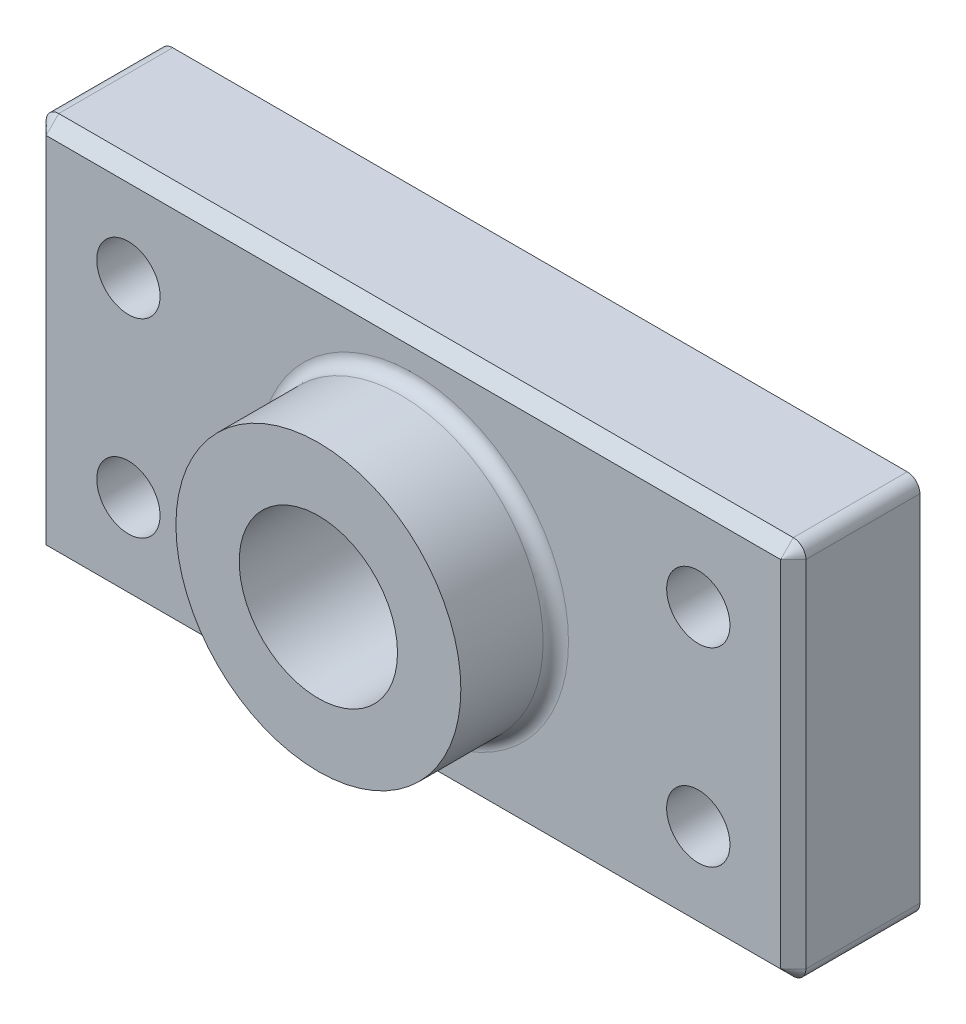
ISO-10303-21;
HEADER;
FILE_DESCRIPTION(('STEP AP214'),'2;1');
FILE_NAME('part.step','',(''),(''),'','','');
FILE_SCHEMA(('AUTOMOTIVE_DESIGN { 1 0 10303 214 1 1 1 1 }'));
ENDSEC;
DATA;
#1=APPLICATION_CONTEXT('core data for automotive mechanical design processes');
#2=APPLICATION_PROTOCOL_DEFINITION('international standard','automotive_design',2000,#1);
#3=PRODUCT_CONTEXT('',#1,'mechanical');
#4=PRODUCT('Part','Part','',(#3));
#5=PRODUCT_RELATED_PRODUCT_CATEGORY('part','',(#4));
#6=PRODUCT_DEFINITION_FORMATION('','',#4);
#7=PRODUCT_DEFINITION_CONTEXT('part definition',#1,'design');
#8=PRODUCT_DEFINITION('design','',#6,#7);
#9=PRODUCT_DEFINITION_SHAPE('','',#8);
#10=(LENGTH_UNIT() NAMED_UNIT(*) SI_UNIT(.MILLI.,.METRE.));
#11=(NAMED_UNIT(*) PLANE_ANGLE_UNIT() SI_UNIT($,.RADIAN.));
#12=(NAMED_UNIT(*) SI_UNIT($,.STERADIAN.) SOLID_ANGLE_UNIT());
#13=UNCERTAINTY_MEASURE_WITH_UNIT(LENGTH_MEASURE(1.E-05),#10,'distance_accuracy_value','');
#14=(GEOMETRIC_REPRESENTATION_CONTEXT(3) GLOBAL_UNCERTAINTY_ASSIGNED_CONTEXT((#13)) GLOBAL_UNIT_ASSIGNED_CONTEXT((#10,
#11,#12)) REPRESENTATION_CONTEXT('',''));
#15=CARTESIAN_POINT('',(0.,0.,0.));
#16=DIRECTION('',(0.,0.,1.));
#17=DIRECTION('',(1.,0.,0.));
#18=AXIS2_PLACEMENT_3D('',#15,#16,#17);
#19=CARTESIAN_POINT('',(0.,0.,25.4));
#20=DIRECTION('',(0.,0.,1.));
#21=DIRECTION('',(1.,0.,0.));
#22=AXIS2_PLACEMENT_3D('',#19,#20,#21);
#23=PLANE('',#22);
#24=DIRECTION('',(0.,-1.,0.));
#25=VECTOR('',#24,1.);
#26=CARTESIAN_POINT('',(-73.66,-35.56,25.4));
#27=LINE('',#26,#25);
#28=CARTESIAN_POINT('',(-73.66,35.56,25.4));
#29=VERTEX_POINT('',#28);
#30=CARTESIAN_POINT('',(-73.66,-35.56,25.4));
#31=VERTEX_POINT('',#30);
#32=EDGE_CURVE('E213',#29,#31,#27,.T.);
#33=ORIENTED_EDGE('',*,*,#32,.T.);
#34=DIRECTION('',(1.,0.,0.));
#35=VECTOR('',#34,1.);
#36=CARTESIAN_POINT('',(73.66,-35.56,25.4));
#37=LINE('',#36,#35);
#38=CARTESIAN_POINT('',(73.66,-35.56,25.4));
#39=VERTEX_POINT('',#38);
#40=EDGE_CURVE('E219',#31,#39,#37,.T.);
#41=ORIENTED_EDGE('',*,*,#40,.T.);
#42=DIRECTION('',(0.,1.,0.));
#43=VECTOR('',#42,1.);
#44=CARTESIAN_POINT('',(73.66,35.56,25.4));
#45=LINE('',#44,#43);
#46=CARTESIAN_POINT('',(73.66,35.56,25.4));
#47=VERTEX_POINT('',#46);
#48=EDGE_CURVE('E216',#39,#47,#45,.T.);
#49=ORIENTED_EDGE('',*,*,#48,.T.);
#50=DIRECTION('',(-1.,0.,0.));
#51=VECTOR('',#50,1.);
#52=CARTESIAN_POINT('',(-73.6599999999999,35.56,25.4));
#53=LINE('',#52,#51);
#54=EDGE_CURVE('E210',#47,#29,#53,.T.);
#55=ORIENTED_EDGE('',*,*,#54,.T.);
#56=EDGE_LOOP('',(#33,#41,#49,#55));
#57=FACE_BOUND('',#56,.T.);
#58=CARTESIAN_POINT('',(0.,0.,25.4));
#59=DIRECTION('',(0.,0.,1.));
#60=DIRECTION('',(1.,0.,0.));
#61=AXIS2_PLACEMENT_3D('',#58,#59,#60);
#62=CIRCLE('',#61,31.115);
#63=CARTESIAN_POINT('',(31.115,0.,25.4));
#64=VERTEX_POINT('',#63);
#65=EDGE_CURVE('E180',#64,#64,#62,.F.);
#66=ORIENTED_EDGE('',*,*,#65,.T.);
#67=EDGE_LOOP('',(#66));
#68=FACE_BOUND('',#67,.T.);
#69=CARTESIAN_POINT('',(57.1500000000001,19.0499999999999,25.4));
#70=DIRECTION('',(0.,0.,1.));
#71=DIRECTION('',(-1.,0.,0.));
#72=AXIS2_PLACEMENT_3D('',#69,#70,#71);
#73=CIRCLE('',#72,6.35000000000001);
#74=CARTESIAN_POINT('',(50.8000000000001,19.0499999999999,25.4));
#75=VERTEX_POINT('',#74);
#76=EDGE_CURVE('E294',#75,#75,#73,.T.);
#77=ORIENTED_EDGE('',*,*,#76,.F.);
#78=EDGE_LOOP('',(#77));
#79=FACE_BOUND('',#78,.T.);
#80=CARTESIAN_POINT('',(-57.15,19.05,25.4));
#81=DIRECTION('',(0.,0.,1.));
#82=DIRECTION('',(1.,0.,0.));
#83=AXIS2_PLACEMENT_3D('',#80,#81,#82);
#84=CIRCLE('',#83,6.35);
#85=CARTESIAN_POINT('',(-50.8,19.05,25.4));
#86=VERTEX_POINT('',#85);
#87=EDGE_CURVE('E310',#86,#86,#84,.T.);
#88=ORIENTED_EDGE('',*,*,#87,.F.);
#89=EDGE_LOOP('',(#88));
#90=FACE_BOUND('',#89,.T.);
#91=CARTESIAN_POINT('',(-57.15,-19.0500000000001,25.4));
#92=DIRECTION('',(0.,0.,1.));
#93=DIRECTION('',(-1.,0.,0.));
#94=AXIS2_PLACEMENT_3D('',#91,#92,#93);
#95=CIRCLE('',#94,6.35);
#96=CARTESIAN_POINT('',(-63.5,-19.0500000000001,25.4));
#97=VERTEX_POINT('',#96);
#98=EDGE_CURVE('E302',#97,#97,#95,.T.);
#99=ORIENTED_EDGE('',*,*,#98,.F.);
#100=EDGE_LOOP('',(#99));
#101=FACE_BOUND('',#100,.T.);
#102=CARTESIAN_POINT('',(57.15,-19.0500000000002,25.4));
#103=DIRECTION('',(0.,0.,1.));
#104=DIRECTION('',(1.,0.,0.));
#105=AXIS2_PLACEMENT_3D('',#102,#103,#104);
#106=CIRCLE('',#105,6.35);
#107=CARTESIAN_POINT('',(63.5,-19.0500000000002,25.4));
#108=VERTEX_POINT('',#107);
#109=EDGE_CURVE('E286',#108,#108,#106,.T.);
#110=ORIENTED_EDGE('',*,*,#109,.F.);
#111=EDGE_LOOP('',(#110));
#112=FACE_BOUND('',#111,.T.);
#113=ADVANCED_FACE('F47',(#57,#68,#79,#90,#101,#112),#23,.T.);
#114=CARTESIAN_POINT('',(0.,0.,0.));
#115=DIRECTION('',(0.,0.,1.));
#116=DIRECTION('',(1.,0.,0.));
#117=AXIS2_PLACEMENT_3D('',#114,#115,#116);
#118=PLANE('',#117);
#119=CARTESIAN_POINT('',(0.,0.,0.));
#120=DIRECTION('',(0.,0.,1.));
#121=DIRECTION('',(1.,0.,0.));
#122=AXIS2_PLACEMENT_3D('',#119,#120,#121);
#123=CIRCLE('',#122,15.875);
#124=CARTESIAN_POINT('',(15.875,0.,0.));
#125=VERTEX_POINT('',#124);
#126=EDGE_CURVE('E176',#125,#125,#123,.T.);
#127=ORIENTED_EDGE('',*,*,#126,.T.);
#128=EDGE_LOOP('',(#127));
#129=FACE_BOUND('',#128,.T.);
#130=DIRECTION('',(0.,1.,0.));
#131=VECTOR('',#130,1.);
#132=CARTESIAN_POINT('',(76.2,-38.1,0.));
#133=LINE('',#132,#131);
#134=CARTESIAN_POINT('',(76.2,-35.56,0.));
#135=VERTEX_POINT('',#134);
#136=CARTESIAN_POINT('',(76.2,35.56,0.));
#137=VERTEX_POINT('',#136);
#138=EDGE_CURVE('E132',#135,#137,#133,.T.);
#139=ORIENTED_EDGE('',*,*,#138,.F.);
#140=CARTESIAN_POINT('',(73.66,-35.56,0.));
#141=DIRECTION('',(0.,0.,1.));
#142=DIRECTION('',(1.,0.,0.));
#143=AXIS2_PLACEMENT_3D('',#140,#141,#142);
#144=CIRCLE('',#143,2.54);
#145=CARTESIAN_POINT('',(73.66,-38.1,0.));
#146=VERTEX_POINT('',#145);
#147=EDGE_CURVE('E143',#135,#146,#144,.F.);
#148=ORIENTED_EDGE('',*,*,#147,.T.);
#149=DIRECTION('',(1.,0.,0.));
#150=VECTOR('',#149,1.);
#151=CARTESIAN_POINT('',(76.2,-38.1,0.));
#152=LINE('',#151,#150);
#153=CARTESIAN_POINT('',(-73.6599999999999,-38.1,0.));
#154=VERTEX_POINT('',#153);
#155=EDGE_CURVE('E160',#154,#146,#152,.T.);
#156=ORIENTED_EDGE('',*,*,#155,.F.);
#157=CARTESIAN_POINT('',(-73.66,-35.56,0.));
#158=DIRECTION('',(0.,0.,1.));
#159=DIRECTION('',(1.,0.,0.));
#160=AXIS2_PLACEMENT_3D('',#157,#158,#159);
#161=CIRCLE('',#160,2.54);
#162=CARTESIAN_POINT('',(-76.2,-35.56,0.));
#163=VERTEX_POINT('',#162);
#164=EDGE_CURVE('E139',#154,#163,#161,.F.);
#165=ORIENTED_EDGE('',*,*,#164,.T.);
#166=DIRECTION('',(0.,-1.,0.));
#167=VECTOR('',#166,1.);
#168=CARTESIAN_POINT('',(-76.2,-38.1,0.));
#169=LINE('',#168,#167);
#170=CARTESIAN_POINT('',(-76.2,35.56,0.));
#171=VERTEX_POINT('',#170);
#172=EDGE_CURVE('E167',#171,#163,#169,.T.);
#173=ORIENTED_EDGE('',*,*,#172,.F.);
#174=CARTESIAN_POINT('',(-73.66,35.56,0.));
#175=DIRECTION('',(0.,0.,1.));
#176=DIRECTION('',(1.,0.,0.));
#177=AXIS2_PLACEMENT_3D('',#174,#175,#176);
#178=CIRCLE('',#177,2.54);
#179=CARTESIAN_POINT('',(-73.6599999999999,38.1,0.));
#180=VERTEX_POINT('',#179);
#181=EDGE_CURVE('E188',#171,#180,#178,.F.);
#182=ORIENTED_EDGE('',*,*,#181,.T.);
#183=DIRECTION('',(-1.,0.,0.));
#184=VECTOR('',#183,1.);
#185=CARTESIAN_POINT('',(76.2,38.1,0.));
#186=LINE('',#185,#184);
#187=CARTESIAN_POINT('',(73.66,38.1,0.));
#188=VERTEX_POINT('',#187);
#189=EDGE_CURVE('E159',#188,#180,#186,.T.);
#190=ORIENTED_EDGE('',*,*,#189,.F.);
#191=CARTESIAN_POINT('',(73.66,35.56,0.));
#192=DIRECTION('',(0.,0.,1.));
#193=DIRECTION('',(1.,0.,0.));
#194=AXIS2_PLACEMENT_3D('',#191,#192,#193);
#195=CIRCLE('',#194,2.54);
#196=EDGE_CURVE('E152',#188,#137,#195,.F.);
#197=ORIENTED_EDGE('',*,*,#196,.T.);
#198=EDGE_LOOP('',(#139,#148,#156,#165,#173,#182,#190,#197));
#199=FACE_BOUND('',#198,.T.);
#200=CARTESIAN_POINT('',(-57.15,19.05,0.));
#201=DIRECTION('',(0.,0.,1.));
#202=DIRECTION('',(1.,0.,0.));
#203=AXIS2_PLACEMENT_3D('',#200,#201,#202);
#204=CIRCLE('',#203,6.35);
#205=CARTESIAN_POINT('',(-50.8,19.05,0.));
#206=VERTEX_POINT('',#205);
#207=EDGE_CURVE('E306',#206,#206,#204,.T.);
#208=ORIENTED_EDGE('',*,*,#207,.T.);
#209=EDGE_LOOP('',(#208));
#210=FACE_BOUND('',#209,.T.);
#211=CARTESIAN_POINT('',(-57.15,-19.0500000000001,0.));
#212=DIRECTION('',(0.,0.,1.));
#213=DIRECTION('',(-1.,0.,0.));
#214=AXIS2_PLACEMENT_3D('',#211,#212,#213);
#215=CIRCLE('',#214,6.35);
#216=CARTESIAN_POINT('',(-63.5,-19.0500000000001,0.));
#217=VERTEX_POINT('',#216);
#218=EDGE_CURVE('E298',#217,#217,#215,.T.);
#219=ORIENTED_EDGE('',*,*,#218,.T.);
#220=EDGE_LOOP('',(#219));
#221=FACE_BOUND('',#220,.T.);
#222=CARTESIAN_POINT('',(57.1500000000001,19.0499999999999,0.));
#223=DIRECTION('',(0.,0.,1.));
#224=DIRECTION('',(-1.,0.,0.));
#225=AXIS2_PLACEMENT_3D('',#222,#223,#224);
#226=CIRCLE('',#225,6.35000000000001);
#227=CARTESIAN_POINT('',(50.8000000000001,19.0499999999999,0.));
#228=VERTEX_POINT('',#227);
#229=EDGE_CURVE('E290',#228,#228,#226,.T.);
#230=ORIENTED_EDGE('',*,*,#229,.T.);
#231=EDGE_LOOP('',(#230));
#232=FACE_BOUND('',#231,.T.);
#233=CARTESIAN_POINT('',(57.15,-19.0500000000002,0.));
#234=DIRECTION('',(0.,0.,1.));
#235=DIRECTION('',(1.,0.,0.));
#236=AXIS2_PLACEMENT_3D('',#233,#234,#235);
#237=CIRCLE('',#236,6.35);
#238=CARTESIAN_POINT('',(63.5,-19.0500000000002,0.));
#239=VERTEX_POINT('',#238);
#240=EDGE_CURVE('E285',#239,#239,#237,.T.);
#241=ORIENTED_EDGE('',*,*,#240,.T.);
#242=EDGE_LOOP('',(#241));
#243=FACE_BOUND('',#242,.T.);
#244=ADVANCED_FACE('F154',(#129,#199,#210,#221,#232,#243),#118,.F.);
#245=CARTESIAN_POINT('',(-76.2,-38.1,25.4));
#246=DIRECTION('',(1.,0.,0.));
#247=DIRECTION('',(0.,0.,-1.));
#248=AXIS2_PLACEMENT_3D('',#245,#246,#247);
#249=PLANE('',#248);
#250=DIRECTION('',(0.,0.,-1.));
#251=VECTOR('',#250,1.);
#252=CARTESIAN_POINT('',(-76.2,-35.56,25.4));
#253=LINE('',#252,#251);
#254=CARTESIAN_POINT('',(-76.2,-35.56,22.86));
#255=VERTEX_POINT('',#254);
#256=EDGE_CURVE('E203',#163,#255,#253,.F.);
#257=ORIENTED_EDGE('',*,*,#256,.T.);
#258=DIRECTION('',(0.,1.,0.));
#259=VECTOR('',#258,1.);
#260=CARTESIAN_POINT('',(-76.2,35.56,22.86));
#261=LINE('',#260,#259);
#262=CARTESIAN_POINT('',(-76.2,35.56,22.86));
#263=VERTEX_POINT('',#262);
#264=EDGE_CURVE('E235',#255,#263,#261,.T.);
#265=ORIENTED_EDGE('',*,*,#264,.T.);
#266=DIRECTION('',(0.,0.,-1.));
#267=VECTOR('',#266,1.);
#268=CARTESIAN_POINT('',(-76.2,35.56,25.4));
#269=LINE('',#268,#267);
#270=EDGE_CURVE('E207',#263,#171,#269,.T.);
#271=ORIENTED_EDGE('',*,*,#270,.T.);
#272=ORIENTED_EDGE('',*,*,#172,.T.);
#273=EDGE_LOOP('',(#257,#265,#271,#272));
#274=FACE_BOUND('',#273,.T.);
#275=ADVANCED_FACE('F321',(#274),#249,.F.);
#276=CARTESIAN_POINT('',(76.2,-38.1,25.4));
#277=DIRECTION('',(0.,1.,0.));
#278=DIRECTION('',(-1.,0.,0.));
#279=AXIS2_PLACEMENT_3D('',#276,#277,#278);
#280=PLANE('',#279);
#281=DIRECTION('',(0.,0.,-1.));
#282=VECTOR('',#281,1.);
#283=CARTESIAN_POINT('',(73.66,-38.1,25.4));
#284=LINE('',#283,#282);
#285=CARTESIAN_POINT('',(73.66,-38.1,22.86));
#286=VERTEX_POINT('',#285);
#287=EDGE_CURVE('E146',#146,#286,#284,.F.);
#288=ORIENTED_EDGE('',*,*,#287,.T.);
#289=DIRECTION('',(-1.,0.,0.));
#290=VECTOR('',#289,1.);
#291=CARTESIAN_POINT('',(-73.6599999999999,-38.1,22.86));
#292=LINE('',#291,#290);
#293=CARTESIAN_POINT('',(-73.66,-38.1,22.86));
#294=VERTEX_POINT('',#293);
#295=EDGE_CURVE('E223',#286,#294,#292,.T.);
#296=ORIENTED_EDGE('',*,*,#295,.T.);
#297=DIRECTION('',(0.,0.,-1.));
#298=VECTOR('',#297,1.);
#299=CARTESIAN_POINT('',(-73.66,-38.1,25.4));
#300=LINE('',#299,#298);
#301=EDGE_CURVE('E151',#294,#154,#300,.T.);
#302=ORIENTED_EDGE('',*,*,#301,.T.);
#303=ORIENTED_EDGE('',*,*,#155,.T.);
#304=EDGE_LOOP('',(#288,#296,#302,#303));
#305=FACE_BOUND('',#304,.T.);
#306=ADVANCED_FACE('F336',(#305),#280,.F.);
#307=CARTESIAN_POINT('',(76.2,-38.1,25.4));
#308=DIRECTION('',(-1.,0.,0.));
#309=DIRECTION('',(0.,0.,1.));
#310=AXIS2_PLACEMENT_3D('',#307,#308,#309);
#311=PLANE('',#310);
#312=DIRECTION('',(0.,0.,-1.));
#313=VECTOR('',#312,1.);
#314=CARTESIAN_POINT('',(76.2,35.56,25.4));
#315=LINE('',#314,#313);
#316=CARTESIAN_POINT('',(76.2,35.56,22.86));
#317=VERTEX_POINT('',#316);
#318=EDGE_CURVE('E140',#137,#317,#315,.F.);
#319=ORIENTED_EDGE('',*,*,#318,.T.);
#320=DIRECTION('',(0.,-1.,0.));
#321=VECTOR('',#320,1.);
#322=CARTESIAN_POINT('',(76.2,-35.56,22.86));
#323=LINE('',#322,#321);
#324=CARTESIAN_POINT('',(76.2,-35.56,22.86));
#325=VERTEX_POINT('',#324);
#326=EDGE_CURVE('E135',#317,#325,#323,.T.);
#327=ORIENTED_EDGE('',*,*,#326,.T.);
#328=DIRECTION('',(0.,0.,-1.));
#329=VECTOR('',#328,1.);
#330=CARTESIAN_POINT('',(76.2,-35.56,25.4));
#331=LINE('',#330,#329);
#332=EDGE_CURVE('E127',#325,#135,#331,.T.);
#333=ORIENTED_EDGE('',*,*,#332,.T.);
#334=ORIENTED_EDGE('',*,*,#138,.T.);
#335=EDGE_LOOP('',(#319,#327,#333,#334));
#336=FACE_BOUND('',#335,.T.);
#337=ADVANCED_FACE('F130',(#336),#311,.F.);
#338=CARTESIAN_POINT('',(76.2,38.1,25.4));
#339=DIRECTION('',(0.,-1.,0.));
#340=DIRECTION('',(1.,0.,0.));
#341=AXIS2_PLACEMENT_3D('',#338,#339,#340);
#342=PLANE('',#341);
#343=DIRECTION('',(0.,0.,-1.));
#344=VECTOR('',#343,1.);
#345=CARTESIAN_POINT('',(-73.66,38.1,25.4));
#346=LINE('',#345,#344);
#347=CARTESIAN_POINT('',(-73.66,38.1,22.86));
#348=VERTEX_POINT('',#347);
#349=EDGE_CURVE('E197',#180,#348,#346,.F.);
#350=ORIENTED_EDGE('',*,*,#349,.T.);
#351=DIRECTION('',(1.,0.,0.));
#352=VECTOR('',#351,1.);
#353=CARTESIAN_POINT('',(73.66,38.1,22.86));
#354=LINE('',#353,#352);
#355=CARTESIAN_POINT('',(73.66,38.1,22.86));
#356=VERTEX_POINT('',#355);
#357=EDGE_CURVE('E11',#348,#356,#354,.T.);
#358=ORIENTED_EDGE('',*,*,#357,.T.);
#359=DIRECTION('',(0.,0.,-1.));
#360=VECTOR('',#359,1.);
#361=CARTESIAN_POINT('',(73.66,38.1,25.4));
#362=LINE('',#361,#360);
#363=EDGE_CURVE('E200',#356,#188,#362,.T.);
#364=ORIENTED_EDGE('',*,*,#363,.T.);
#365=ORIENTED_EDGE('',*,*,#189,.T.);
#366=EDGE_LOOP('',(#350,#358,#364,#365));
#367=FACE_BOUND('',#366,.T.);
#368=ADVANCED_FACE('F375',(#367),#342,.F.);
#369=CARTESIAN_POINT('',(-57.15,19.05,25.4));
#370=DIRECTION('',(0.,0.,-1.));
#371=DIRECTION('',(-1.,0.,0.));
#372=AXIS2_PLACEMENT_3D('',#369,#370,#371);
#373=CYLINDRICAL_SURFACE('',#372,6.35);
#374=ORIENTED_EDGE('',*,*,#87,.T.);
#375=EDGE_LOOP('',(#374));
#376=FACE_BOUND('',#375,.T.);
#377=ORIENTED_EDGE('',*,*,#207,.F.);
#378=EDGE_LOOP('',(#377));
#379=FACE_BOUND('',#378,.T.);
#380=ADVANCED_FACE('F372',(#376,#379),#373,.F.);
#381=CARTESIAN_POINT('',(-57.15,-19.0500000000001,25.4));
#382=DIRECTION('',(0.,0.,-1.));
#383=DIRECTION('',(-1.,0.,0.));
#384=AXIS2_PLACEMENT_3D('',#381,#382,#383);
#385=CYLINDRICAL_SURFACE('',#384,6.35);
#386=ORIENTED_EDGE('',*,*,#98,.T.);
#387=EDGE_LOOP('',(#386));
#388=FACE_BOUND('',#387,.T.);
#389=ORIENTED_EDGE('',*,*,#218,.F.);
#390=EDGE_LOOP('',(#389));
#391=FACE_BOUND('',#390,.T.);
#392=ADVANCED_FACE('F539',(#388,#391),#385,.F.);
#393=CARTESIAN_POINT('',(57.1500000000001,19.0499999999999,25.4));
#394=DIRECTION('',(0.,0.,-1.));
#395=DIRECTION('',(-1.,0.,0.));
#396=AXIS2_PLACEMENT_3D('',#393,#394,#395);
#397=CYLINDRICAL_SURFACE('',#396,6.35000000000001);
#398=ORIENTED_EDGE('',*,*,#76,.T.);
#399=EDGE_LOOP('',(#398));
#400=FACE_BOUND('',#399,.T.);
#401=ORIENTED_EDGE('',*,*,#229,.F.);
#402=EDGE_LOOP('',(#401));
#403=FACE_BOUND('',#402,.T.);
#404=ADVANCED_FACE('F530',(#400,#403),#397,.F.);
#405=CARTESIAN_POINT('',(57.15,-19.0500000000002,25.4));
#406=DIRECTION('',(0.,0.,-1.));
#407=DIRECTION('',(-1.,0.,0.));
#408=AXIS2_PLACEMENT_3D('',#405,#406,#407);
#409=CYLINDRICAL_SURFACE('',#408,6.35);
#410=ORIENTED_EDGE('',*,*,#109,.T.);
#411=EDGE_LOOP('',(#410));
#412=FACE_BOUND('',#411,.T.);
#413=ORIENTED_EDGE('',*,*,#240,.F.);
#414=EDGE_LOOP('',(#413));
#415=FACE_BOUND('',#414,.T.);
#416=ADVANCED_FACE('F521',(#412,#415),#409,.F.);
#417=CARTESIAN_POINT('',(0.,0.,44.45));
#418=DIRECTION('',(0.,0.,-1.));
#419=DIRECTION('',(-1.,0.,0.));
#420=AXIS2_PLACEMENT_3D('',#417,#418,#419);
#421=CYLINDRICAL_SURFACE('',#420,28.575);
#422=CARTESIAN_POINT('',(0.,0.,27.94));
#423=DIRECTION('',(0.,0.,1.));
#424=DIRECTION('',(1.,0.,0.));
#425=AXIS2_PLACEMENT_3D('',#422,#423,#424);
#426=CIRCLE('',#425,28.575);
#427=CARTESIAN_POINT('',(-28.575,0.,27.94));
#428=VERTEX_POINT('',#427);
#429=EDGE_CURVE('E165',#428,#428,#426,.T.);
#430=CARTESIAN_POINT('',(0.,0.,44.45));
#431=DIRECTION('',(0.,0.,1.));
#432=DIRECTION('',(1.,0.,0.));
#433=AXIS2_PLACEMENT_3D('',#430,#431,#432);
#434=CIRCLE('',#433,28.575);
#435=CARTESIAN_POINT('',(-28.575,0.,44.45));
#436=VERTEX_POINT('',#435);
#437=EDGE_CURVE('E175',#436,#436,#434,.T.);
#438=CARTESIAN_POINT('',(-28.575,0.,27.94));
#439=CARTESIAN_POINT('',(-28.575,0.,28.1119791666667));
#440=CARTESIAN_POINT('',(-28.575,0.,28.2839583333333));
#441=CARTESIAN_POINT('',(-28.575,0.,28.6279166666667));
#442=CARTESIAN_POINT('',(-28.575,0.,28.7998958333333));
#443=CARTESIAN_POINT('',(-28.575,0.,29.1438541666667));
#444=CARTESIAN_POINT('',(-28.575,0.,29.3158333333333));
#445=CARTESIAN_POINT('',(-28.575,0.,29.6597916666667));
#446=CARTESIAN_POINT('',(-28.575,0.,29.8317708333333));
#447=CARTESIAN_POINT('',(-28.575,0.,30.1757291666667));
#448=CARTESIAN_POINT('',(-28.575,0.,30.3477083333333));
#449=CARTESIAN_POINT('',(-28.575,0.,30.6916666666667));
#450=CARTESIAN_POINT('',(-28.575,0.,30.8636458333333));
#451=CARTESIAN_POINT('',(-28.575,0.,31.2076041666667));
#452=CARTESIAN_POINT('',(-28.575,0.,31.3795833333333));
#453=CARTESIAN_POINT('',(-28.575,0.,31.7235416666667));
#454=CARTESIAN_POINT('',(-28.575,0.,31.8955208333333));
#455=CARTESIAN_POINT('',(-28.575,0.,32.2394791666667));
#456=CARTESIAN_POINT('',(-28.575,0.,32.4114583333333));
#457=CARTESIAN_POINT('',(-28.575,0.,32.7554166666667));
#458=CARTESIAN_POINT('',(-28.575,0.,32.9273958333333));
#459=CARTESIAN_POINT('',(-28.575,0.,33.2713541666667));
#460=CARTESIAN_POINT('',(-28.575,0.,33.4433333333333));
#461=CARTESIAN_POINT('',(-28.575,0.,33.7872916666667));
#462=CARTESIAN_POINT('',(-28.575,0.,33.9592708333333));
#463=CARTESIAN_POINT('',(-28.575,0.,34.3032291666667));
#464=CARTESIAN_POINT('',(-28.575,0.,34.4752083333333));
#465=CARTESIAN_POINT('',(-28.575,0.,34.8191666666667));
#466=CARTESIAN_POINT('',(-28.575,0.,34.9911458333333));
#467=CARTESIAN_POINT('',(-28.575,0.,35.3351041666667));
#468=CARTESIAN_POINT('',(-28.575,0.,35.5070833333333));
#469=CARTESIAN_POINT('',(-28.575,0.,35.8510416666667));
#470=CARTESIAN_POINT('',(-28.575,0.,36.0230208333333));
#471=CARTESIAN_POINT('',(-28.575,0.,36.3669791666667));
#472=CARTESIAN_POINT('',(-28.575,0.,36.5389583333333));
#473=CARTESIAN_POINT('',(-28.575,0.,36.8829166666667));
#474=CARTESIAN_POINT('',(-28.575,0.,37.0548958333333));
#475=CARTESIAN_POINT('',(-28.575,0.,37.3988541666667));
#476=CARTESIAN_POINT('',(-28.575,0.,37.5708333333333));
#477=CARTESIAN_POINT('',(-28.575,0.,37.9147916666667));
#478=CARTESIAN_POINT('',(-28.575,0.,38.0867708333333));
#479=CARTESIAN_POINT('',(-28.575,0.,38.4307291666667));
#480=CARTESIAN_POINT('',(-28.575,0.,38.6027083333333));
#481=CARTESIAN_POINT('',(-28.575,0.,38.9466666666667));
#482=CARTESIAN_POINT('',(-28.575,0.,39.1186458333333));
#483=CARTESIAN_POINT('',(-28.575,0.,39.4626041666667));
#484=CARTESIAN_POINT('',(-28.575,0.,39.6345833333333));
#485=CARTESIAN_POINT('',(-28.575,0.,39.9785416666667));
#486=CARTESIAN_POINT('',(-28.575,0.,40.1505208333333));
#487=CARTESIAN_POINT('',(-28.575,0.,40.4944791666667));
#488=CARTESIAN_POINT('',(-28.575,0.,40.6664583333333));
#489=CARTESIAN_POINT('',(-28.575,0.,41.0104166666667));
#490=CARTESIAN_POINT('',(-28.575,0.,41.1823958333333));
#491=CARTESIAN_POINT('',(-28.575,0.,41.5263541666667));
#492=CARTESIAN_POINT('',(-28.575,0.,41.6983333333333));
#493=CARTESIAN_POINT('',(-28.575,0.,42.0422916666667));
#494=CARTESIAN_POINT('',(-28.575,0.,42.2142708333333));
#495=CARTESIAN_POINT('',(-28.575,0.,42.5582291666667));
#496=CARTESIAN_POINT('',(-28.575,0.,42.7302083333333));
#497=CARTESIAN_POINT('',(-28.575,0.,43.0741666666667));
#498=CARTESIAN_POINT('',(-28.575,0.,43.2461458333333));
#499=CARTESIAN_POINT('',(-28.575,0.,43.5901041666667));
#500=CARTESIAN_POINT('',(-28.575,0.,43.7620833333333));
#501=CARTESIAN_POINT('',(-28.575,0.,44.1060416666667));
#502=CARTESIAN_POINT('',(-28.575,0.,44.2780208333333));
#503=CARTESIAN_POINT('',(-28.575,0.,44.45));
#504=B_SPLINE_CURVE_WITH_KNOTS('',3,(#438,#439,#440,#441,#442,#443,#444,#445,#446,#447,#448,
#449,#450,#451,#452,#453,#454,#455,#456,#457,#458,#459,#460,#461,#462,#463,#464,#465,#466,#467,
#468,#469,#470,#471,#472,#473,#474,#475,#476,#477,#478,#479,#480,#481,#482,#483,#484,#485,#486,
#487,#488,#489,#490,#491,#492,#493,#494,#495,#496,#497,#498,#499,#500,#501,#502,#503),
.UNSPECIFIED.,.F.,.F.,(4,2,2,2,2,2,2,2,2,2,2,2,2,2,2,2,2,2,2,2,2,2,2,2,2,2,2,2,2,2,2,2,4),(0.,
0.515937500000001,1.031875,1.5478125,2.06375,2.5796875,3.095625,3.6115625,4.1275,4.6434375,
5.159375,5.6753125,6.19125,6.7071875,7.223125,7.7390625,8.255,8.7709375,9.286875,9.8028125,
10.31875,10.8346875,11.350625,11.8665625,12.3825,12.8984375,13.414375,13.9303125,14.44625,
14.9621875,15.478125,15.9940625,16.51),.UNSPECIFIED.);
#505=EDGE_CURVE('BSEAM512',#428,#436,#504,.T.);
#506=ORIENTED_EDGE('',*,*,#429,.T.);
#507=ORIENTED_EDGE('',*,*,#437,.F.);
#508=ORIENTED_EDGE('',*,*,#505,.T.);
#509=ORIENTED_EDGE('',*,*,#505,.F.);
#510=EDGE_LOOP('',(#506,#508,#507,#509));
#511=FACE_BOUND('',#510,.T.);
#512=ADVANCED_FACE('F512',(#511),#421,.T.);
#513=CARTESIAN_POINT('',(0.,0.,44.45));
#514=DIRECTION('',(0.,0.,1.));
#515=DIRECTION('',(1.,0.,0.));
#516=AXIS2_PLACEMENT_3D('',#513,#514,#515);
#517=PLANE('',#516);
#518=CARTESIAN_POINT('',(0.,0.,44.45));
#519=DIRECTION('',(0.,0.,1.));
#520=DIRECTION('',(1.,0.,0.));
#521=AXIS2_PLACEMENT_3D('',#518,#519,#520);
#522=CIRCLE('',#521,15.875);
#523=CARTESIAN_POINT('',(15.875,0.,44.45));
#524=VERTEX_POINT('',#523);
#525=EDGE_CURVE('E171',#524,#524,#522,.T.);
#526=ORIENTED_EDGE('',*,*,#525,.F.);
#527=EDGE_LOOP('',(#526));
#528=FACE_BOUND('',#527,.T.);
#529=ORIENTED_EDGE('',*,*,#437,.T.);
#530=EDGE_LOOP('',(#529));
#531=FACE_BOUND('',#530,.T.);
#532=ADVANCED_FACE('F503',(#528,#531),#517,.T.);
#533=CARTESIAN_POINT('',(0.,0.,0.));
#534=DIRECTION('',(0.,0.,1.));
#535=DIRECTION('',(1.,0.,0.));
#536=AXIS2_PLACEMENT_3D('',#533,#534,#535);
#537=CYLINDRICAL_SURFACE('',#536,15.875);
#538=ORIENTED_EDGE('',*,*,#525,.T.);
#539=EDGE_LOOP('',(#538));
#540=FACE_BOUND('',#539,.T.);
#541=ORIENTED_EDGE('',*,*,#126,.F.);
#542=EDGE_LOOP('',(#541));
#543=FACE_BOUND('',#542,.T.);
#544=ADVANCED_FACE('F385',(#540,#543),#537,.F.);
#545=CARTESIAN_POINT('',(0.,0.,27.94));
#546=DIRECTION('',(0.,0.,1.));
#547=DIRECTION('',(1.,0.,0.));
#548=AXIS2_PLACEMENT_3D('',#545,#546,#547);
#549=TOROIDAL_SURFACE('',#548,31.115,2.54);
#550=ORIENTED_EDGE('',*,*,#65,.F.);
#551=EDGE_LOOP('',(#550));
#552=FACE_BOUND('',#551,.T.);
#553=ORIENTED_EDGE('',*,*,#429,.F.);
#554=EDGE_LOOP('',(#553));
#555=FACE_BOUND('',#554,.T.);
#556=ADVANCED_FACE('F383',(#552,#555),#549,.F.);
#557=CARTESIAN_POINT('',(73.66,-35.56,25.4));
#558=DIRECTION('',(0.,0.,-1.));
#559=DIRECTION('',(-1.,0.,0.));
#560=AXIS2_PLACEMENT_3D('',#557,#558,#559);
#561=CYLINDRICAL_SURFACE('',#560,2.54);
#562=ORIENTED_EDGE('',*,*,#332,.F.);
#563=CARTESIAN_POINT('',(73.66,-35.56,22.86));
#564=DIRECTION('',(0.,0.,1.));
#565=DIRECTION('',(1.,0.,0.));
#566=AXIS2_PLACEMENT_3D('',#563,#564,#565);
#567=CIRCLE('',#566,2.54);
#568=EDGE_CURVE('E227',#325,#286,#567,.F.);
#569=ORIENTED_EDGE('',*,*,#568,.T.);
#570=ORIENTED_EDGE('',*,*,#287,.F.);
#571=ORIENTED_EDGE('',*,*,#147,.F.);
#572=EDGE_LOOP('',(#562,#569,#570,#571));
#573=FACE_BOUND('',#572,.T.);
#574=ADVANCED_FACE('F144',(#573),#561,.T.);
#575=CARTESIAN_POINT('',(73.66,35.56,25.4));
#576=DIRECTION('',(0.,0.,-1.));
#577=DIRECTION('',(-1.,0.,0.));
#578=AXIS2_PLACEMENT_3D('',#575,#576,#577);
#579=CYLINDRICAL_SURFACE('',#578,2.54);
#580=ORIENTED_EDGE('',*,*,#363,.F.);
#581=CARTESIAN_POINT('',(73.66,35.56,22.86));
#582=DIRECTION('',(0.,0.,1.));
#583=DIRECTION('',(1.,0.,0.));
#584=AXIS2_PLACEMENT_3D('',#581,#582,#583);
#585=CIRCLE('',#584,2.54);
#586=EDGE_CURVE('E238',#356,#317,#585,.F.);
#587=ORIENTED_EDGE('',*,*,#586,.T.);
#588=ORIENTED_EDGE('',*,*,#318,.F.);
#589=ORIENTED_EDGE('',*,*,#196,.F.);
#590=EDGE_LOOP('',(#580,#587,#588,#589));
#591=FACE_BOUND('',#590,.T.);
#592=ADVANCED_FACE('F389',(#591),#579,.T.);
#593=CARTESIAN_POINT('',(-73.66,35.56,25.4));
#594=DIRECTION('',(0.,0.,-1.));
#595=DIRECTION('',(-1.,0.,0.));
#596=AXIS2_PLACEMENT_3D('',#593,#594,#595);
#597=CYLINDRICAL_SURFACE('',#596,2.54);
#598=ORIENTED_EDGE('',*,*,#270,.F.);
#599=CARTESIAN_POINT('',(-73.66,35.56,22.86));
#600=DIRECTION('',(0.,0.,1.));
#601=DIRECTION('',(1.,0.,0.));
#602=AXIS2_PLACEMENT_3D('',#599,#600,#601);
#603=CIRCLE('',#602,2.54);
#604=EDGE_CURVE('E58',#263,#348,#603,.F.);
#605=ORIENTED_EDGE('',*,*,#604,.T.);
#606=ORIENTED_EDGE('',*,*,#349,.F.);
#607=ORIENTED_EDGE('',*,*,#181,.F.);
#608=EDGE_LOOP('',(#598,#605,#606,#607));
#609=FACE_BOUND('',#608,.T.);
#610=ADVANCED_FACE('F352',(#609),#597,.T.);
#611=CARTESIAN_POINT('',(-73.66,-35.56,25.4));
#612=DIRECTION('',(0.,0.,-1.));
#613=DIRECTION('',(-1.,0.,0.));
#614=AXIS2_PLACEMENT_3D('',#611,#612,#613);
#615=CYLINDRICAL_SURFACE('',#614,2.54);
#616=ORIENTED_EDGE('',*,*,#301,.F.);
#617=CARTESIAN_POINT('',(-73.66,-35.56,22.86));
#618=DIRECTION('',(0.,0.,1.));
#619=DIRECTION('',(1.,0.,0.));
#620=AXIS2_PLACEMENT_3D('',#617,#618,#619);
#621=CIRCLE('',#620,2.54);
#622=EDGE_CURVE('E230',#294,#255,#621,.F.);
#623=ORIENTED_EDGE('',*,*,#622,.T.);
#624=ORIENTED_EDGE('',*,*,#256,.F.);
#625=ORIENTED_EDGE('',*,*,#164,.F.);
#626=EDGE_LOOP('',(#616,#623,#624,#625));
#627=FACE_BOUND('',#626,.T.);
#628=ADVANCED_FACE('F327',(#627),#615,.T.);
#629=CARTESIAN_POINT('',(0.,35.56,25.4));
#630=DIRECTION('',(0.,0.707106781186545,0.70710678118655));
#631=DIRECTION('',(1.,0.,0.));
#632=AXIS2_PLACEMENT_3D('',#629,#630,#631);
#633=PLANE('',#632);
#634=DIRECTION('',(0.,-0.707106781186549,0.707106781186545));
#635=VECTOR('',#634,1.);
#636=CARTESIAN_POINT('',(73.66,38.1,22.86));
#637=LINE('',#636,#635);
#638=EDGE_CURVE('E264',#356,#47,#637,.T.);
#639=ORIENTED_EDGE('',*,*,#638,.F.);
#640=ORIENTED_EDGE('',*,*,#357,.F.);
#641=DIRECTION('',(0.,0.707106781186549,-0.707106781186545));
#642=VECTOR('',#641,1.);
#643=CARTESIAN_POINT('',(-73.66,35.56,25.4));
#644=LINE('',#643,#642);
#645=EDGE_CURVE('E52',#29,#348,#644,.T.);
#646=ORIENTED_EDGE('',*,*,#645,.F.);
#647=ORIENTED_EDGE('',*,*,#54,.F.);
#648=EDGE_LOOP('',(#639,#640,#646,#647));
#649=FACE_BOUND('',#648,.T.);
#650=ADVANCED_FACE('F50',(#649),#633,.T.);
#651=CARTESIAN_POINT('',(-73.66,35.56,22.86));
#652=DIRECTION('',(0.,0.,-1.));
#653=DIRECTION('',(-1.,0.,0.));
#654=AXIS2_PLACEMENT_3D('',#651,#652,#653);
#655=CONICAL_SURFACE('',#654,2.54000000000003,0.785398163397451);
#656=ORIENTED_EDGE('',*,*,#645,.T.);
#657=ORIENTED_EDGE('',*,*,#604,.F.);
#658=DIRECTION('',(-0.707106781186549,0.,-0.707106781186545));
#659=VECTOR('',#658,1.);
#660=CARTESIAN_POINT('',(-73.66,35.56,25.4));
#661=LINE('',#660,#659);
#662=EDGE_CURVE('E261',#29,#263,#661,.T.);
#663=ORIENTED_EDGE('',*,*,#662,.F.);
#664=EDGE_LOOP('',(#656,#657,#663));
#665=FACE_BOUND('',#664,.T.);
#666=ADVANCED_FACE('F353',(#665),#655,.T.);
#667=CARTESIAN_POINT('',(73.66,35.56,22.86));
#668=DIRECTION('',(0.,0.,-1.));
#669=DIRECTION('',(-1.,0.,0.));
#670=AXIS2_PLACEMENT_3D('',#667,#668,#669);
#671=CONICAL_SURFACE('',#670,2.54000000000003,0.785398163397451);
#672=ORIENTED_EDGE('',*,*,#586,.F.);
#673=ORIENTED_EDGE('',*,*,#638,.T.);
#674=DIRECTION('',(-0.707106781186549,0.,0.707106781186545));
#675=VECTOR('',#674,1.);
#676=CARTESIAN_POINT('',(76.2,35.56,22.86));
#677=LINE('',#676,#675);
#678=EDGE_CURVE('E257',#317,#47,#677,.T.);
#679=ORIENTED_EDGE('',*,*,#678,.F.);
#680=EDGE_LOOP('',(#672,#673,#679));
#681=FACE_BOUND('',#680,.T.);
#682=ADVANCED_FACE('F355',(#681),#671,.T.);
#683=CARTESIAN_POINT('',(-73.66,0.,25.4));
#684=DIRECTION('',(-0.707106781186545,0.,0.707106781186549));
#685=DIRECTION('',(0.,1.,0.));
#686=AXIS2_PLACEMENT_3D('',#683,#684,#685);
#687=PLANE('',#686);
#688=ORIENTED_EDGE('',*,*,#662,.T.);
#689=ORIENTED_EDGE('',*,*,#264,.F.);
#690=DIRECTION('',(-0.707106781186549,0.,-0.707106781186545));
#691=VECTOR('',#690,1.);
#692=CARTESIAN_POINT('',(-73.66,-35.56,25.4));
#693=LINE('',#692,#691);
#694=EDGE_CURVE('E253',#31,#255,#693,.T.);
#695=ORIENTED_EDGE('',*,*,#694,.F.);
#696=ORIENTED_EDGE('',*,*,#32,.F.);
#697=EDGE_LOOP('',(#688,#689,#695,#696));
#698=FACE_BOUND('',#697,.T.);
#699=ADVANCED_FACE('F351',(#698),#687,.T.);
#700=CARTESIAN_POINT('',(73.66,0.,25.4));
#701=DIRECTION('',(0.707106781186545,0.,0.707106781186549));
#702=DIRECTION('',(0.,-1.,0.));
#703=AXIS2_PLACEMENT_3D('',#700,#701,#702);
#704=PLANE('',#703);
#705=ORIENTED_EDGE('',*,*,#678,.T.);
#706=ORIENTED_EDGE('',*,*,#48,.F.);
#707=DIRECTION('',(-0.707106781186549,0.,0.707106781186545));
#708=VECTOR('',#707,1.);
#709=CARTESIAN_POINT('',(76.2,-35.56,22.86));
#710=LINE('',#709,#708);
#711=EDGE_CURVE('E249',#325,#39,#710,.T.);
#712=ORIENTED_EDGE('',*,*,#711,.F.);
#713=ORIENTED_EDGE('',*,*,#326,.F.);
#714=EDGE_LOOP('',(#705,#706,#712,#713));
#715=FACE_BOUND('',#714,.T.);
#716=ADVANCED_FACE('F345',(#715),#704,.T.);
#717=CARTESIAN_POINT('',(-73.66,-35.56,22.86));
#718=DIRECTION('',(0.,0.,-1.));
#719=DIRECTION('',(-1.,0.,0.));
#720=AXIS2_PLACEMENT_3D('',#717,#718,#719);
#721=CONICAL_SURFACE('',#720,2.54000000000003,0.785398163397451);
#722=ORIENTED_EDGE('',*,*,#694,.T.);
#723=ORIENTED_EDGE('',*,*,#622,.F.);
#724=DIRECTION('',(0.,-0.707106781186549,-0.707106781186545));
#725=VECTOR('',#724,1.);
#726=CARTESIAN_POINT('',(-73.66,-35.56,25.4));
#727=LINE('',#726,#725);
#728=EDGE_CURVE('E246',#31,#294,#727,.T.);
#729=ORIENTED_EDGE('',*,*,#728,.F.);
#730=EDGE_LOOP('',(#722,#723,#729));
#731=FACE_BOUND('',#730,.T.);
#732=ADVANCED_FACE('F331',(#731),#721,.T.);
#733=CARTESIAN_POINT('',(73.66,-35.56,22.86));
#734=DIRECTION('',(0.,0.,-1.));
#735=DIRECTION('',(-1.,0.,0.));
#736=AXIS2_PLACEMENT_3D('',#733,#734,#735);
#737=CONICAL_SURFACE('',#736,2.54000000000003,0.785398163397451);
#738=ORIENTED_EDGE('',*,*,#568,.F.);
#739=ORIENTED_EDGE('',*,*,#711,.T.);
#740=DIRECTION('',(0.,0.707106781186549,0.707106781186545));
#741=VECTOR('',#740,1.);
#742=CARTESIAN_POINT('',(73.66,-38.1,22.86));
#743=LINE('',#742,#741);
#744=EDGE_CURVE('E243',#286,#39,#743,.T.);
#745=ORIENTED_EDGE('',*,*,#744,.F.);
#746=EDGE_LOOP('',(#738,#739,#745));
#747=FACE_BOUND('',#746,.T.);
#748=ADVANCED_FACE('F342',(#747),#737,.T.);
#749=CARTESIAN_POINT('',(0.,-35.56,25.4));
#750=DIRECTION('',(0.,-0.707106781186545,0.707106781186549));
#751=DIRECTION('',(-1.,0.,0.));
#752=AXIS2_PLACEMENT_3D('',#749,#750,#751);
#753=PLANE('',#752);
#754=ORIENTED_EDGE('',*,*,#728,.T.);
#755=ORIENTED_EDGE('',*,*,#295,.F.);
#756=ORIENTED_EDGE('',*,*,#744,.T.);
#757=ORIENTED_EDGE('',*,*,#40,.F.);
#758=EDGE_LOOP('',(#754,#755,#756,#757));
#759=FACE_BOUND('',#758,.T.);
#760=ADVANCED_FACE('F339',(#759),#753,.T.);
#761=CLOSED_SHELL('',(#113,#244,#275,#306,#337,#368,#380,#392,#404,#416,#512,#532,#544,#556,
#574,#592,#610,#628,#650,#666,#682,#699,#716,#732,#748,#760));
#762=MANIFOLD_SOLID_BREP('B2',#761);
#763=ADVANCED_BREP_SHAPE_REPRESENTATION('',(#18,#762),#14);
#764=SHAPE_DEFINITION_REPRESENTATION(#9,#763);
ENDSEC;
END-ISO-10303-21;
